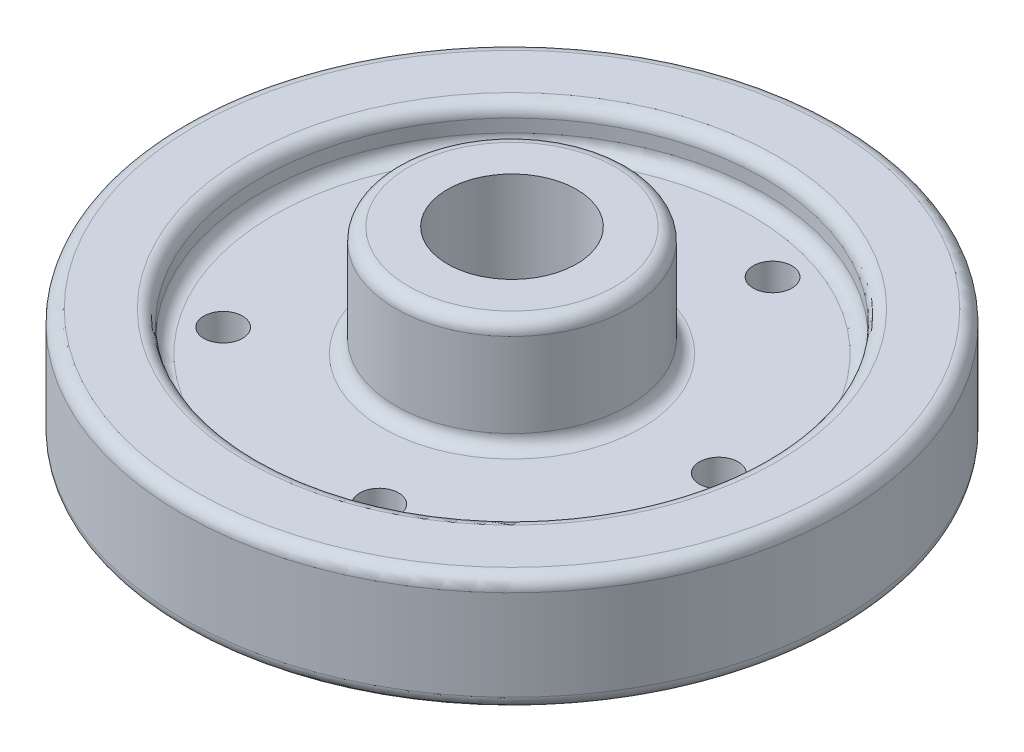
ISO-10303-21;
HEADER;
FILE_DESCRIPTION(('STEP AP214'),'2;1');
FILE_NAME('part.step','',(''),(''),'','','');
FILE_SCHEMA(('AUTOMOTIVE_DESIGN { 1 0 10303 214 1 1 1 1 }'));
ENDSEC;
DATA;
#1=APPLICATION_CONTEXT('core data for automotive mechanical design processes');
#2=APPLICATION_PROTOCOL_DEFINITION('international standard','automotive_design',2000,#1);
#3=PRODUCT_CONTEXT('',#1,'mechanical');
#4=PRODUCT('Part','Part','',(#3));
#5=PRODUCT_RELATED_PRODUCT_CATEGORY('part','',(#4));
#6=PRODUCT_DEFINITION_FORMATION('','',#4);
#7=PRODUCT_DEFINITION_CONTEXT('part definition',#1,'design');
#8=PRODUCT_DEFINITION('design','',#6,#7);
#9=PRODUCT_DEFINITION_SHAPE('','',#8);
#10=(LENGTH_UNIT() NAMED_UNIT(*) SI_UNIT(.MILLI.,.METRE.));
#11=(NAMED_UNIT(*) PLANE_ANGLE_UNIT() SI_UNIT($,.RADIAN.));
#12=(NAMED_UNIT(*) SI_UNIT($,.STERADIAN.) SOLID_ANGLE_UNIT());
#13=UNCERTAINTY_MEASURE_WITH_UNIT(LENGTH_MEASURE(1.E-05),#10,'distance_accuracy_value','');
#14=(GEOMETRIC_REPRESENTATION_CONTEXT(3) GLOBAL_UNCERTAINTY_ASSIGNED_CONTEXT((#13)) GLOBAL_UNIT_ASSIGNED_CONTEXT((#10,
#11,#12)) REPRESENTATION_CONTEXT('',''));
#15=CARTESIAN_POINT('',(0.,0.,0.));
#16=DIRECTION('',(0.,0.,1.));
#17=DIRECTION('',(1.,0.,0.));
#18=AXIS2_PLACEMENT_3D('',#15,#16,#17);
#19=CARTESIAN_POINT('',(0.,19.05,0.));
#20=DIRECTION('',(0.,-1.,0.));
#21=DIRECTION('',(0.,0.,-1.));
#22=AXIS2_PLACEMENT_3D('',#19,#20,#21);
#23=PLANE('',#22);
#24=CARTESIAN_POINT('',(50.8,19.05,0.));
#25=DIRECTION('',(0.,-1.,0.));
#26=DIRECTION('',(0.,0.,-1.));
#27=AXIS2_PLACEMENT_3D('',#24,#25,#26);
#28=CIRCLE('',#27,4.7625);
#29=CARTESIAN_POINT('',(50.8,19.05,-4.7625));
#30=VERTEX_POINT('',#29);
#31=EDGE_CURVE('E103',#30,#30,#28,.T.);
#32=ORIENTED_EDGE('',*,*,#31,.T.);
#33=EDGE_LOOP('',(#32));
#34=FACE_BOUND('',#33,.T.);
#35=CARTESIAN_POINT('',(15.6980633142473,19.05,-48.3136710277938));
#36=DIRECTION('',(0.,-1.,0.));
#37=DIRECTION('',(0.,0.,-1.));
#38=AXIS2_PLACEMENT_3D('',#35,#36,#37);
#39=CIRCLE('',#38,4.76250000000003);
#40=CARTESIAN_POINT('',(15.6980633142473,19.05,-53.0761710277938));
#41=VERTEX_POINT('',#40);
#42=EDGE_CURVE('E125',#41,#41,#39,.T.);
#43=ORIENTED_EDGE('',*,*,#42,.T.);
#44=EDGE_LOOP('',(#43));
#45=FACE_BOUND('',#44,.T.);
#46=CARTESIAN_POINT('',(-41.0980633142475,19.05,-29.8594908164574));
#47=DIRECTION('',(0.,-1.,0.));
#48=DIRECTION('',(0.,0.,-1.));
#49=AXIS2_PLACEMENT_3D('',#46,#47,#48);
#50=CIRCLE('',#49,4.7625);
#51=CARTESIAN_POINT('',(-41.0980633142475,19.05,-34.6219908164574));
#52=VERTEX_POINT('',#51);
#53=EDGE_CURVE('E119',#52,#52,#50,.T.);
#54=ORIENTED_EDGE('',*,*,#53,.T.);
#55=EDGE_LOOP('',(#54));
#56=FACE_BOUND('',#55,.T.);
#57=CARTESIAN_POINT('',(-41.098063314247,19.05,29.859490816458));
#58=DIRECTION('',(0.,-1.,0.));
#59=DIRECTION('',(0.,0.,-1.));
#60=AXIS2_PLACEMENT_3D('',#57,#58,#59);
#61=CIRCLE('',#60,4.7625);
#62=CARTESIAN_POINT('',(-41.098063314247,19.05,25.096990816458));
#63=VERTEX_POINT('',#62);
#64=EDGE_CURVE('E113',#63,#63,#61,.T.);
#65=ORIENTED_EDGE('',*,*,#64,.T.);
#66=EDGE_LOOP('',(#65));
#67=FACE_BOUND('',#66,.T.);
#68=CARTESIAN_POINT('',(15.6980633142473,19.05,48.3136710277938));
#69=DIRECTION('',(0.,-1.,0.));
#70=DIRECTION('',(0.,0.,-1.));
#71=AXIS2_PLACEMENT_3D('',#68,#69,#70);
#72=CIRCLE('',#71,4.76250000000018);
#73=CARTESIAN_POINT('',(15.6980633142473,19.05,43.5511710277936));
#74=VERTEX_POINT('',#73);
#75=EDGE_CURVE('E107',#74,#74,#72,.T.);
#76=ORIENTED_EDGE('',*,*,#75,.T.);
#77=EDGE_LOOP('',(#76));
#78=FACE_BOUND('',#77,.T.);
#79=CARTESIAN_POINT('',(0.,19.05,0.));
#80=DIRECTION('',(0.,-1.,0.));
#81=DIRECTION('',(0.,0.,-1.));
#82=AXIS2_PLACEMENT_3D('',#79,#80,#81);
#83=CIRCLE('',#82,58.7375);
#84=CARTESIAN_POINT('',(0.,19.05,-58.7375));
#85=VERTEX_POINT('',#84);
#86=EDGE_CURVE('E100',#85,#85,#83,.T.);
#87=ORIENTED_EDGE('',*,*,#86,.F.);
#88=EDGE_LOOP('',(#87));
#89=FACE_BOUND('',#88,.T.);
#90=CARTESIAN_POINT('',(0.,19.05,0.));
#91=DIRECTION('',(0.,-1.,0.));
#92=DIRECTION('',(0.,0.,-1.));
#93=AXIS2_PLACEMENT_3D('',#90,#91,#92);
#94=CIRCLE('',#93,31.75);
#95=CARTESIAN_POINT('',(0.,19.05,-31.75));
#96=VERTEX_POINT('',#95);
#97=EDGE_CURVE('E10',#96,#96,#94,.T.);
#98=ORIENTED_EDGE('',*,*,#97,.T.);
#99=EDGE_LOOP('',(#98));
#100=FACE_BOUND('',#99,.T.);
#101=ADVANCED_FACE('F33',(#34,#45,#56,#67,#78,#89,#100),#23,.F.);
#102=CARTESIAN_POINT('',(0.,22.225,0.));
#103=DIRECTION('',(0.,-1.,0.));
#104=DIRECTION('',(0.,0.,-1.));
#105=AXIS2_PLACEMENT_3D('',#102,#103,#104);
#106=TOROIDAL_SURFACE('',#105,31.75,3.175);
#107=CARTESIAN_POINT('',(0.,22.225,0.));
#108=DIRECTION('',(0.,-1.,0.));
#109=DIRECTION('',(0.,0.,-1.));
#110=AXIS2_PLACEMENT_3D('',#107,#108,#109);
#111=CIRCLE('',#110,28.575);
#112=CARTESIAN_POINT('',(0.,22.225,-28.575));
#113=VERTEX_POINT('',#112);
#114=EDGE_CURVE('E39',#113,#113,#111,.T.);
#115=ORIENTED_EDGE('',*,*,#114,.T.);
#116=EDGE_LOOP('',(#115));
#117=FACE_BOUND('',#116,.T.);
#118=ORIENTED_EDGE('',*,*,#97,.F.);
#119=EDGE_LOOP('',(#118));
#120=FACE_BOUND('',#119,.T.);
#121=ADVANCED_FACE('F208',(#117,#120),#106,.F.);
#122=CARTESIAN_POINT('',(0.,0.,0.));
#123=DIRECTION('',(0.,-1.,0.));
#124=DIRECTION('',(0.,0.,-1.));
#125=AXIS2_PLACEMENT_3D('',#122,#123,#124);
#126=CYLINDRICAL_SURFACE('',#125,28.575);
#127=ORIENTED_EDGE('',*,*,#114,.F.);
#128=EDGE_LOOP('',(#127));
#129=FACE_BOUND('',#128,.T.);
#130=CARTESIAN_POINT('',(0.,42.8752,0.));
#131=DIRECTION('',(0.,-1.,0.));
#132=DIRECTION('',(0.,0.,-1.));
#133=AXIS2_PLACEMENT_3D('',#130,#131,#132);
#134=CIRCLE('',#133,28.575);
#135=CARTESIAN_POINT('',(0.,42.8752,-28.575));
#136=VERTEX_POINT('',#135);
#137=EDGE_CURVE('E43',#136,#136,#134,.T.);
#138=ORIENTED_EDGE('',*,*,#137,.T.);
#139=EDGE_LOOP('',(#138));
#140=FACE_BOUND('',#139,.T.);
#141=ADVANCED_FACE('F212',(#129,#140),#126,.T.);
#142=CARTESIAN_POINT('',(0.,42.8752,0.));
#143=DIRECTION('',(0.,-1.,0.));
#144=DIRECTION('',(0.,0.,-1.));
#145=AXIS2_PLACEMENT_3D('',#142,#143,#144);
#146=TOROIDAL_SURFACE('',#145,25.4,3.175);
#147=ORIENTED_EDGE('',*,*,#137,.F.);
#148=EDGE_LOOP('',(#147));
#149=FACE_BOUND('',#148,.T.);
#150=CARTESIAN_POINT('',(0.,46.0502,0.));
#151=DIRECTION('',(0.,-1.,0.));
#152=DIRECTION('',(0.,0.,-1.));
#153=AXIS2_PLACEMENT_3D('',#150,#151,#152);
#154=CIRCLE('',#153,25.4);
#155=CARTESIAN_POINT('',(0.,46.0502,-25.4));
#156=VERTEX_POINT('',#155);
#157=EDGE_CURVE('E47',#156,#156,#154,.T.);
#158=ORIENTED_EDGE('',*,*,#157,.T.);
#159=EDGE_LOOP('',(#158));
#160=FACE_BOUND('',#159,.T.);
#161=ADVANCED_FACE('F216',(#149,#160),#146,.T.);
#162=CARTESIAN_POINT('',(0.,46.0502,0.));
#163=DIRECTION('',(0.,-1.,0.));
#164=DIRECTION('',(0.,0.,-1.));
#165=AXIS2_PLACEMENT_3D('',#162,#163,#164);
#166=PLANE('',#165);
#167=ORIENTED_EDGE('',*,*,#157,.F.);
#168=EDGE_LOOP('',(#167));
#169=FACE_BOUND('',#168,.T.);
#170=CARTESIAN_POINT('',(0.,46.0502,0.));
#171=DIRECTION('',(0.,-1.,0.));
#172=DIRECTION('',(0.,0.,-1.));
#173=AXIS2_PLACEMENT_3D('',#170,#171,#172);
#174=CIRCLE('',#173,15.875);
#175=CARTESIAN_POINT('',(0.,46.0502,-15.875));
#176=VERTEX_POINT('',#175);
#177=EDGE_CURVE('E52',#176,#176,#174,.T.);
#178=ORIENTED_EDGE('',*,*,#177,.T.);
#179=EDGE_LOOP('',(#178));
#180=FACE_BOUND('',#179,.T.);
#181=ADVANCED_FACE('F223',(#169,#180),#166,.F.);
#182=CARTESIAN_POINT('',(0.,0.,0.));
#183=DIRECTION('',(0.,-1.,0.));
#184=DIRECTION('',(0.,0.,-1.));
#185=AXIS2_PLACEMENT_3D('',#182,#183,#184);
#186=CYLINDRICAL_SURFACE('',#185,15.875);
#187=ORIENTED_EDGE('',*,*,#177,.F.);
#188=EDGE_LOOP('',(#187));
#189=FACE_BOUND('',#188,.T.);
#190=CARTESIAN_POINT('',(0.,0.,0.));
#191=DIRECTION('',(0.,-1.,0.));
#192=DIRECTION('',(0.,0.,-1.));
#193=AXIS2_PLACEMENT_3D('',#190,#191,#192);
#194=CIRCLE('',#193,15.875);
#195=CARTESIAN_POINT('',(0.,0.,-15.875));
#196=VERTEX_POINT('',#195);
#197=EDGE_CURVE('E55',#196,#196,#194,.T.);
#198=ORIENTED_EDGE('',*,*,#197,.T.);
#199=EDGE_LOOP('',(#198));
#200=FACE_BOUND('',#199,.T.);
#201=ADVANCED_FACE('F227',(#189,#200),#186,.F.);
#202=CARTESIAN_POINT('',(0.,0.,0.));
#203=DIRECTION('',(0.,1.,0.));
#204=DIRECTION('',(0.,0.,1.));
#205=AXIS2_PLACEMENT_3D('',#202,#203,#204);
#206=PLANE('',#205);
#207=ORIENTED_EDGE('',*,*,#197,.F.);
#208=EDGE_LOOP('',(#207));
#209=FACE_BOUND('',#208,.T.);
#210=CARTESIAN_POINT('',(0.,0.,0.));
#211=DIRECTION('',(0.,-1.,0.));
#212=DIRECTION('',(0.,0.,-1.));
#213=AXIS2_PLACEMENT_3D('',#210,#211,#212);
#214=CIRCLE('',#213,25.4);
#215=CARTESIAN_POINT('',(0.,0.,-25.4));
#216=VERTEX_POINT('',#215);
#217=EDGE_CURVE('E58',#216,#216,#214,.T.);
#218=ORIENTED_EDGE('',*,*,#217,.T.);
#219=EDGE_LOOP('',(#218));
#220=FACE_BOUND('',#219,.T.);
#221=ADVANCED_FACE('F231',(#209,#220),#206,.F.);
#222=CARTESIAN_POINT('',(0.,3.175,0.));
#223=DIRECTION('',(0.,-1.,0.));
#224=DIRECTION('',(0.,0.,-1.));
#225=AXIS2_PLACEMENT_3D('',#222,#223,#224);
#226=TOROIDAL_SURFACE('',#225,25.4,3.175);
#227=ORIENTED_EDGE('',*,*,#217,.F.);
#228=EDGE_LOOP('',(#227));
#229=FACE_BOUND('',#228,.T.);
#230=CARTESIAN_POINT('',(0.,3.17500000000002,0.));
#231=DIRECTION('',(0.,-1.,0.));
#232=DIRECTION('',(0.,0.,-1.));
#233=AXIS2_PLACEMENT_3D('',#230,#231,#232);
#234=CIRCLE('',#233,28.575);
#235=CARTESIAN_POINT('',(0.,3.17500000000002,-28.575));
#236=VERTEX_POINT('',#235);
#237=EDGE_CURVE('E61',#236,#236,#234,.T.);
#238=ORIENTED_EDGE('',*,*,#237,.T.);
#239=EDGE_LOOP('',(#238));
#240=FACE_BOUND('',#239,.T.);
#241=ADVANCED_FACE('F235',(#229,#240),#226,.T.);
#242=CARTESIAN_POINT('',(0.,0.,0.));
#243=DIRECTION('',(0.,-1.,0.));
#244=DIRECTION('',(0.,0.,-1.));
#245=AXIS2_PLACEMENT_3D('',#242,#243,#244);
#246=CYLINDRICAL_SURFACE('',#245,28.575);
#247=ORIENTED_EDGE('',*,*,#237,.F.);
#248=EDGE_LOOP('',(#247));
#249=FACE_BOUND('',#248,.T.);
#250=CARTESIAN_POINT('',(0.,9.525,0.));
#251=DIRECTION('',(0.,-1.,0.));
#252=DIRECTION('',(0.,0.,-1.));
#253=AXIS2_PLACEMENT_3D('',#250,#251,#252);
#254=CIRCLE('',#253,28.575);
#255=CARTESIAN_POINT('',(0.,9.525,-28.575));
#256=VERTEX_POINT('',#255);
#257=EDGE_CURVE('E64',#256,#256,#254,.T.);
#258=ORIENTED_EDGE('',*,*,#257,.T.);
#259=EDGE_LOOP('',(#258));
#260=FACE_BOUND('',#259,.T.);
#261=ADVANCED_FACE('F147',(#249,#260),#246,.T.);
#262=CARTESIAN_POINT('',(0.,9.525,0.));
#263=DIRECTION('',(0.,1.,0.));
#264=DIRECTION('',(0.,0.,1.));
#265=AXIS2_PLACEMENT_3D('',#262,#263,#264);
#266=PLANE('',#265);
#267=CARTESIAN_POINT('',(50.8,9.525,0.));
#268=DIRECTION('',(0.,-1.,0.));
#269=DIRECTION('',(0.,0.,-1.));
#270=AXIS2_PLACEMENT_3D('',#267,#268,#269);
#271=CIRCLE('',#270,4.7625);
#272=CARTESIAN_POINT('',(50.8,9.525,-4.7625));
#273=VERTEX_POINT('',#272);
#274=EDGE_CURVE('E128',#273,#273,#271,.T.);
#275=ORIENTED_EDGE('',*,*,#274,.F.);
#276=EDGE_LOOP('',(#275));
#277=FACE_BOUND('',#276,.T.);
#278=CARTESIAN_POINT('',(15.6980633142473,9.525,-48.3136710277938));
#279=DIRECTION('',(0.,-1.,0.));
#280=DIRECTION('',(0.,0.,-1.));
#281=AXIS2_PLACEMENT_3D('',#278,#279,#280);
#282=CIRCLE('',#281,4.76250000000003);
#283=CARTESIAN_POINT('',(15.6980633142473,9.525,-53.0761710277938));
#284=VERTEX_POINT('',#283);
#285=EDGE_CURVE('E122',#284,#284,#282,.T.);
#286=ORIENTED_EDGE('',*,*,#285,.F.);
#287=EDGE_LOOP('',(#286));
#288=FACE_BOUND('',#287,.T.);
#289=CARTESIAN_POINT('',(-41.0980633142475,9.525,-29.8594908164574));
#290=DIRECTION('',(0.,-1.,0.));
#291=DIRECTION('',(0.,0.,-1.));
#292=AXIS2_PLACEMENT_3D('',#289,#290,#291);
#293=CIRCLE('',#292,4.7625);
#294=CARTESIAN_POINT('',(-41.0980633142475,9.525,-34.6219908164574));
#295=VERTEX_POINT('',#294);
#296=EDGE_CURVE('E116',#295,#295,#293,.T.);
#297=ORIENTED_EDGE('',*,*,#296,.F.);
#298=EDGE_LOOP('',(#297));
#299=FACE_BOUND('',#298,.T.);
#300=CARTESIAN_POINT('',(-41.098063314247,9.525,29.859490816458));
#301=DIRECTION('',(0.,-1.,0.));
#302=DIRECTION('',(0.,0.,-1.));
#303=AXIS2_PLACEMENT_3D('',#300,#301,#302);
#304=CIRCLE('',#303,4.7625);
#305=CARTESIAN_POINT('',(-41.098063314247,9.525,25.096990816458));
#306=VERTEX_POINT('',#305);
#307=EDGE_CURVE('E110',#306,#306,#304,.T.);
#308=ORIENTED_EDGE('',*,*,#307,.F.);
#309=EDGE_LOOP('',(#308));
#310=FACE_BOUND('',#309,.T.);
#311=CARTESIAN_POINT('',(15.6980633142473,9.525,48.3136710277938));
#312=DIRECTION('',(0.,-1.,0.));
#313=DIRECTION('',(0.,0.,-1.));
#314=AXIS2_PLACEMENT_3D('',#311,#312,#313);
#315=CIRCLE('',#314,4.76250000000018);
#316=CARTESIAN_POINT('',(15.6980633142473,9.525,43.5511710277936));
#317=VERTEX_POINT('',#316);
#318=EDGE_CURVE('E104',#317,#317,#315,.T.);
#319=ORIENTED_EDGE('',*,*,#318,.F.);
#320=EDGE_LOOP('',(#319));
#321=FACE_BOUND('',#320,.T.);
#322=ORIENTED_EDGE('',*,*,#257,.F.);
#323=EDGE_LOOP('',(#322));
#324=FACE_BOUND('',#323,.T.);
#325=CARTESIAN_POINT('',(0.,9.525,0.));
#326=DIRECTION('',(0.,-1.,0.));
#327=DIRECTION('',(0.,0.,-1.));
#328=AXIS2_PLACEMENT_3D('',#325,#326,#327);
#329=CIRCLE('',#328,58.7375);
#330=CARTESIAN_POINT('',(0.,9.525,-58.7375));
#331=VERTEX_POINT('',#330);
#332=EDGE_CURVE('E67',#331,#331,#329,.T.);
#333=ORIENTED_EDGE('',*,*,#332,.T.);
#334=EDGE_LOOP('',(#333));
#335=FACE_BOUND('',#334,.T.);
#336=ADVANCED_FACE('F143',(#277,#288,#299,#310,#321,#324,#335),#266,.F.);
#337=CARTESIAN_POINT('',(0.,6.35,0.));
#338=DIRECTION('',(0.,-1.,0.));
#339=DIRECTION('',(0.,0.,-1.));
#340=AXIS2_PLACEMENT_3D('',#337,#338,#339);
#341=TOROIDAL_SURFACE('',#340,58.7375,3.175);
#342=ORIENTED_EDGE('',*,*,#332,.F.);
#343=EDGE_LOOP('',(#342));
#344=FACE_BOUND('',#343,.T.);
#345=CARTESIAN_POINT('',(0.,6.34999999999998,0.));
#346=DIRECTION('',(0.,-1.,0.));
#347=DIRECTION('',(0.,0.,-1.));
#348=AXIS2_PLACEMENT_3D('',#345,#346,#347);
#349=CIRCLE('',#348,61.9125);
#350=CARTESIAN_POINT('',(0.,6.34999999999998,-61.9125));
#351=VERTEX_POINT('',#350);
#352=EDGE_CURVE('E70',#351,#351,#349,.T.);
#353=ORIENTED_EDGE('',*,*,#352,.T.);
#354=EDGE_LOOP('',(#353));
#355=FACE_BOUND('',#354,.T.);
#356=ADVANCED_FACE('F146',(#344,#355),#341,.F.);
#357=CARTESIAN_POINT('',(0.,0.,0.));
#358=DIRECTION('',(0.,-1.,0.));
#359=DIRECTION('',(0.,0.,-1.));
#360=AXIS2_PLACEMENT_3D('',#357,#358,#359);
#361=CYLINDRICAL_SURFACE('',#360,61.9125);
#362=ORIENTED_EDGE('',*,*,#352,.F.);
#363=EDGE_LOOP('',(#362));
#364=FACE_BOUND('',#363,.T.);
#365=CARTESIAN_POINT('',(0.,3.17500000000002,0.));
#366=DIRECTION('',(0.,-1.,0.));
#367=DIRECTION('',(0.,0.,-1.));
#368=AXIS2_PLACEMENT_3D('',#365,#366,#367);
#369=CIRCLE('',#368,61.9125);
#370=CARTESIAN_POINT('',(0.,3.17500000000002,-61.9125));
#371=VERTEX_POINT('',#370);
#372=EDGE_CURVE('E73',#371,#371,#369,.T.);
#373=ORIENTED_EDGE('',*,*,#372,.T.);
#374=EDGE_LOOP('',(#373));
#375=FACE_BOUND('',#374,.T.);
#376=ADVANCED_FACE('F163',(#364,#375),#361,.F.);
#377=CARTESIAN_POINT('',(0.,3.175,0.));
#378=DIRECTION('',(0.,-1.,0.));
#379=DIRECTION('',(0.,0.,-1.));
#380=AXIS2_PLACEMENT_3D('',#377,#378,#379);
#381=TOROIDAL_SURFACE('',#380,65.0875,3.175);
#382=ORIENTED_EDGE('',*,*,#372,.F.);
#383=EDGE_LOOP('',(#382));
#384=FACE_BOUND('',#383,.T.);
#385=CARTESIAN_POINT('',(0.,0.,0.));
#386=DIRECTION('',(0.,-1.,0.));
#387=DIRECTION('',(0.,0.,-1.));
#388=AXIS2_PLACEMENT_3D('',#385,#386,#387);
#389=CIRCLE('',#388,65.0875);
#390=CARTESIAN_POINT('',(0.,0.,-65.0875));
#391=VERTEX_POINT('',#390);
#392=EDGE_CURVE('E76',#391,#391,#389,.T.);
#393=ORIENTED_EDGE('',*,*,#392,.T.);
#394=EDGE_LOOP('',(#393));
#395=FACE_BOUND('',#394,.T.);
#396=ADVANCED_FACE('F169',(#384,#395),#381,.T.);
#397=CARTESIAN_POINT('',(0.,0.,0.));
#398=DIRECTION('',(0.,1.,0.));
#399=DIRECTION('',(0.,0.,1.));
#400=AXIS2_PLACEMENT_3D('',#397,#398,#399);
#401=PLANE('',#400);
#402=ORIENTED_EDGE('',*,*,#392,.F.);
#403=EDGE_LOOP('',(#402));
#404=FACE_BOUND('',#403,.T.);
#405=CARTESIAN_POINT('',(0.,0.,0.));
#406=DIRECTION('',(0.,-1.,0.));
#407=DIRECTION('',(0.,0.,-1.));
#408=AXIS2_PLACEMENT_3D('',#405,#406,#407);
#409=CIRCLE('',#408,77.7875);
#410=CARTESIAN_POINT('',(0.,0.,-77.7875));
#411=VERTEX_POINT('',#410);
#412=EDGE_CURVE('E79',#411,#411,#409,.T.);
#413=ORIENTED_EDGE('',*,*,#412,.T.);
#414=EDGE_LOOP('',(#413));
#415=FACE_BOUND('',#414,.T.);
#416=ADVANCED_FACE('F175',(#404,#415),#401,.F.);
#417=CARTESIAN_POINT('',(0.,3.175,0.));
#418=DIRECTION('',(0.,-1.,0.));
#419=DIRECTION('',(0.,0.,-1.));
#420=AXIS2_PLACEMENT_3D('',#417,#418,#419);
#421=TOROIDAL_SURFACE('',#420,77.7875,3.175);
#422=ORIENTED_EDGE('',*,*,#412,.F.);
#423=EDGE_LOOP('',(#422));
#424=FACE_BOUND('',#423,.T.);
#425=CARTESIAN_POINT('',(0.,3.17500000000002,0.));
#426=DIRECTION('',(0.,-1.,0.));
#427=DIRECTION('',(0.,0.,-1.));
#428=AXIS2_PLACEMENT_3D('',#425,#426,#427);
#429=CIRCLE('',#428,80.9625);
#430=CARTESIAN_POINT('',(0.,3.17500000000002,-80.9625));
#431=VERTEX_POINT('',#430);
#432=EDGE_CURVE('E82',#431,#431,#429,.T.);
#433=ORIENTED_EDGE('',*,*,#432,.T.);
#434=EDGE_LOOP('',(#433));
#435=FACE_BOUND('',#434,.T.);
#436=ADVANCED_FACE('F181',(#424,#435),#421,.T.);
#437=CARTESIAN_POINT('',(0.,0.,0.));
#438=DIRECTION('',(0.,-1.,0.));
#439=DIRECTION('',(0.,0.,-1.));
#440=AXIS2_PLACEMENT_3D('',#437,#438,#439);
#441=CYLINDRICAL_SURFACE('',#440,80.9625);
#442=ORIENTED_EDGE('',*,*,#432,.F.);
#443=EDGE_LOOP('',(#442));
#444=FACE_BOUND('',#443,.T.);
#445=CARTESIAN_POINT('',(0.,25.4,0.));
#446=DIRECTION('',(0.,-1.,0.));
#447=DIRECTION('',(0.,0.,-1.));
#448=AXIS2_PLACEMENT_3D('',#445,#446,#447);
#449=CIRCLE('',#448,80.9625);
#450=CARTESIAN_POINT('',(0.,25.4,-80.9625));
#451=VERTEX_POINT('',#450);
#452=EDGE_CURVE('E85',#451,#451,#449,.T.);
#453=ORIENTED_EDGE('',*,*,#452,.T.);
#454=EDGE_LOOP('',(#453));
#455=FACE_BOUND('',#454,.T.);
#456=ADVANCED_FACE('F187',(#444,#455),#441,.T.);
#457=CARTESIAN_POINT('',(0.,25.4,0.));
#458=DIRECTION('',(0.,-1.,0.));
#459=DIRECTION('',(0.,0.,-1.));
#460=AXIS2_PLACEMENT_3D('',#457,#458,#459);
#461=TOROIDAL_SURFACE('',#460,77.7875,3.175);
#462=CARTESIAN_POINT('',(0.,28.575,0.));
#463=DIRECTION('',(0.,-1.,0.));
#464=DIRECTION('',(0.,0.,-1.));
#465=AXIS2_PLACEMENT_3D('',#462,#463,#464);
#466=CIRCLE('',#465,77.7875);
#467=CARTESIAN_POINT('',(0.,28.575,-77.7875));
#468=VERTEX_POINT('',#467);
#469=EDGE_CURVE('E88',#468,#468,#466,.T.);
#470=ORIENTED_EDGE('',*,*,#469,.T.);
#471=EDGE_LOOP('',(#470));
#472=FACE_BOUND('',#471,.T.);
#473=ORIENTED_EDGE('',*,*,#452,.F.);
#474=EDGE_LOOP('',(#473));
#475=FACE_BOUND('',#474,.T.);
#476=ADVANCED_FACE('F193',(#472,#475),#461,.T.);
#477=CARTESIAN_POINT('',(0.,28.575,0.));
#478=DIRECTION('',(0.,-1.,0.));
#479=DIRECTION('',(0.,0.,-1.));
#480=AXIS2_PLACEMENT_3D('',#477,#478,#479);
#481=PLANE('',#480);
#482=ORIENTED_EDGE('',*,*,#469,.F.);
#483=EDGE_LOOP('',(#482));
#484=FACE_BOUND('',#483,.T.);
#485=CARTESIAN_POINT('',(0.,28.575,0.));
#486=DIRECTION('',(0.,-1.,0.));
#487=DIRECTION('',(0.,0.,-1.));
#488=AXIS2_PLACEMENT_3D('',#485,#486,#487);
#489=CIRCLE('',#488,65.0875);
#490=CARTESIAN_POINT('',(0.,28.575,-65.0875));
#491=VERTEX_POINT('',#490);
#492=EDGE_CURVE('E91',#491,#491,#489,.T.);
#493=ORIENTED_EDGE('',*,*,#492,.T.);
#494=EDGE_LOOP('',(#493));
#495=FACE_BOUND('',#494,.T.);
#496=ADVANCED_FACE('F198',(#484,#495),#481,.F.);
#497=CARTESIAN_POINT('',(0.,25.4,0.));
#498=DIRECTION('',(0.,-1.,0.));
#499=DIRECTION('',(0.,0.,-1.));
#500=AXIS2_PLACEMENT_3D('',#497,#498,#499);
#501=TOROIDAL_SURFACE('',#500,65.0875,3.175);
#502=CARTESIAN_POINT('',(0.,25.4,0.));
#503=DIRECTION('',(0.,-1.,0.));
#504=DIRECTION('',(0.,0.,-1.));
#505=AXIS2_PLACEMENT_3D('',#502,#503,#504);
#506=CIRCLE('',#505,61.9125);
#507=CARTESIAN_POINT('',(0.,25.4,-61.9125));
#508=VERTEX_POINT('',#507);
#509=EDGE_CURVE('E94',#508,#508,#506,.T.);
#510=ORIENTED_EDGE('',*,*,#509,.T.);
#511=EDGE_LOOP('',(#510));
#512=FACE_BOUND('',#511,.T.);
#513=ORIENTED_EDGE('',*,*,#492,.F.);
#514=EDGE_LOOP('',(#513));
#515=FACE_BOUND('',#514,.T.);
#516=ADVANCED_FACE('F204',(#512,#515),#501,.T.);
#517=CARTESIAN_POINT('',(0.,0.,0.));
#518=DIRECTION('',(0.,-1.,0.));
#519=DIRECTION('',(0.,0.,-1.));
#520=AXIS2_PLACEMENT_3D('',#517,#518,#519);
#521=CYLINDRICAL_SURFACE('',#520,61.9125);
#522=ORIENTED_EDGE('',*,*,#509,.F.);
#523=EDGE_LOOP('',(#522));
#524=FACE_BOUND('',#523,.T.);
#525=CARTESIAN_POINT('',(0.,22.225,0.));
#526=DIRECTION('',(0.,-1.,0.));
#527=DIRECTION('',(0.,0.,-1.));
#528=AXIS2_PLACEMENT_3D('',#525,#526,#527);
#529=CIRCLE('',#528,61.9125);
#530=CARTESIAN_POINT('',(0.,22.225,-61.9125));
#531=VERTEX_POINT('',#530);
#532=EDGE_CURVE('E97',#531,#531,#529,.T.);
#533=ORIENTED_EDGE('',*,*,#532,.T.);
#534=EDGE_LOOP('',(#533));
#535=FACE_BOUND('',#534,.T.);
#536=ADVANCED_FACE('F297',(#524,#535),#521,.F.);
#537=CARTESIAN_POINT('',(0.,22.225,0.));
#538=DIRECTION('',(0.,-1.,0.));
#539=DIRECTION('',(0.,0.,-1.));
#540=AXIS2_PLACEMENT_3D('',#537,#538,#539);
#541=TOROIDAL_SURFACE('',#540,58.7375,3.175);
#542=ORIENTED_EDGE('',*,*,#86,.T.);
#543=EDGE_LOOP('',(#542));
#544=FACE_BOUND('',#543,.T.);
#545=ORIENTED_EDGE('',*,*,#532,.F.);
#546=EDGE_LOOP('',(#545));
#547=FACE_BOUND('',#546,.T.);
#548=ADVANCED_FACE('F307',(#544,#547),#541,.F.);
#549=CARTESIAN_POINT('',(15.6980633142473,19.05,48.3136710277938));
#550=DIRECTION('',(0.,-1.,0.));
#551=DIRECTION('',(0.,0.,-1.));
#552=AXIS2_PLACEMENT_3D('',#549,#550,#551);
#553=CYLINDRICAL_SURFACE('',#552,4.76250000000018);
#554=ORIENTED_EDGE('',*,*,#75,.F.);
#555=EDGE_LOOP('',(#554));
#556=FACE_BOUND('',#555,.T.);
#557=ORIENTED_EDGE('',*,*,#318,.T.);
#558=EDGE_LOOP('',(#557));
#559=FACE_BOUND('',#558,.T.);
#560=ADVANCED_FACE('F316',(#556,#559),#553,.F.);
#561=CARTESIAN_POINT('',(-41.098063314247,19.05,29.859490816458));
#562=DIRECTION('',(0.,-1.,0.));
#563=DIRECTION('',(0.,0.,-1.));
#564=AXIS2_PLACEMENT_3D('',#561,#562,#563);
#565=CYLINDRICAL_SURFACE('',#564,4.7625);
#566=ORIENTED_EDGE('',*,*,#64,.F.);
#567=EDGE_LOOP('',(#566));
#568=FACE_BOUND('',#567,.T.);
#569=ORIENTED_EDGE('',*,*,#307,.T.);
#570=EDGE_LOOP('',(#569));
#571=FACE_BOUND('',#570,.T.);
#572=ADVANCED_FACE('F382',(#568,#571),#565,.F.);
#573=CARTESIAN_POINT('',(-41.0980633142475,19.05,-29.8594908164574));
#574=DIRECTION('',(0.,-1.,0.));
#575=DIRECTION('',(0.,0.,-1.));
#576=AXIS2_PLACEMENT_3D('',#573,#574,#575);
#577=CYLINDRICAL_SURFACE('',#576,4.7625);
#578=ORIENTED_EDGE('',*,*,#53,.F.);
#579=EDGE_LOOP('',(#578));
#580=FACE_BOUND('',#579,.T.);
#581=ORIENTED_EDGE('',*,*,#296,.T.);
#582=EDGE_LOOP('',(#581));
#583=FACE_BOUND('',#582,.T.);
#584=ADVANCED_FACE('F389',(#580,#583),#577,.F.);
#585=CARTESIAN_POINT('',(15.6980633142473,19.05,-48.3136710277938));
#586=DIRECTION('',(0.,-1.,0.));
#587=DIRECTION('',(0.,0.,-1.));
#588=AXIS2_PLACEMENT_3D('',#585,#586,#587);
#589=CYLINDRICAL_SURFACE('',#588,4.76250000000003);
#590=ORIENTED_EDGE('',*,*,#42,.F.);
#591=EDGE_LOOP('',(#590));
#592=FACE_BOUND('',#591,.T.);
#593=ORIENTED_EDGE('',*,*,#285,.T.);
#594=EDGE_LOOP('',(#593));
#595=FACE_BOUND('',#594,.T.);
#596=ADVANCED_FACE('F139',(#592,#595),#589,.F.);
#597=CARTESIAN_POINT('',(50.8,19.05,0.));
#598=DIRECTION('',(0.,-1.,0.));
#599=DIRECTION('',(0.,0.,-1.));
#600=AXIS2_PLACEMENT_3D('',#597,#598,#599);
#601=CYLINDRICAL_SURFACE('',#600,4.7625);
#602=ORIENTED_EDGE('',*,*,#31,.F.);
#603=EDGE_LOOP('',(#602));
#604=FACE_BOUND('',#603,.T.);
#605=ORIENTED_EDGE('',*,*,#274,.T.);
#606=EDGE_LOOP('',(#605));
#607=FACE_BOUND('',#606,.T.);
#608=ADVANCED_FACE('F136',(#604,#607),#601,.F.);
#609=CLOSED_SHELL('',(#101,#121,#141,#161,#181,#201,#221,#241,#261,#336,#356,#376,#396,#416,
#436,#456,#476,#496,#516,#536,#548,#560,#572,#584,#596,#608));
#610=MANIFOLD_SOLID_BREP('B2',#609);
#611=ADVANCED_BREP_SHAPE_REPRESENTATION('',(#18,#610),#14);
#612=SHAPE_DEFINITION_REPRESENTATION(#9,#611);
ENDSEC;
END-ISO-10303-21;
